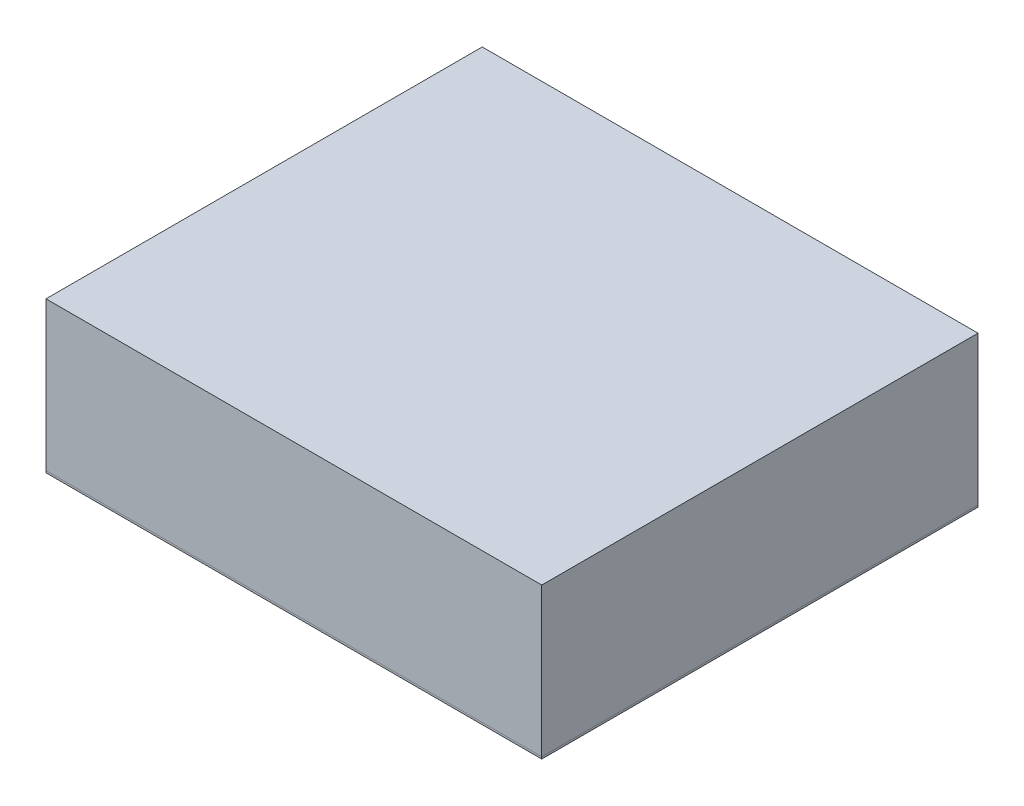
ISO-10303-21;
HEADER;
FILE_DESCRIPTION(('STEP AP214'),'2;1');
FILE_NAME('part.step','',(''),(''),'','','');
FILE_SCHEMA(('AUTOMOTIVE_DESIGN { 1 0 10303 214 1 1 1 1 }'));
ENDSEC;
DATA;
#1=APPLICATION_CONTEXT('core data for automotive mechanical design processes');
#2=APPLICATION_PROTOCOL_DEFINITION('international standard','automotive_design',2000,#1);
#3=PRODUCT_CONTEXT('',#1,'mechanical');
#4=PRODUCT('Part','Part','',(#3));
#5=PRODUCT_RELATED_PRODUCT_CATEGORY('part','',(#4));
#6=PRODUCT_DEFINITION_FORMATION('','',#4);
#7=PRODUCT_DEFINITION_CONTEXT('part definition',#1,'design');
#8=PRODUCT_DEFINITION('design','',#6,#7);
#9=PRODUCT_DEFINITION_SHAPE('','',#8);
#10=(LENGTH_UNIT() NAMED_UNIT(*) SI_UNIT(.MILLI.,.METRE.));
#11=(NAMED_UNIT(*) PLANE_ANGLE_UNIT() SI_UNIT($,.RADIAN.));
#12=(NAMED_UNIT(*) SI_UNIT($,.STERADIAN.) SOLID_ANGLE_UNIT());
#13=UNCERTAINTY_MEASURE_WITH_UNIT(LENGTH_MEASURE(1.E-05),#10,'distance_accuracy_value','');
#14=(GEOMETRIC_REPRESENTATION_CONTEXT(3) GLOBAL_UNCERTAINTY_ASSIGNED_CONTEXT((#13)) GLOBAL_UNIT_ASSIGNED_CONTEXT((#10,
#11,#12)) REPRESENTATION_CONTEXT('',''));
#15=CARTESIAN_POINT('',(0.,0.,0.));
#16=DIRECTION('',(0.,0.,1.));
#17=DIRECTION('',(1.,0.,0.));
#18=AXIS2_PLACEMENT_3D('',#15,#16,#17);
#19=CARTESIAN_POINT('',(-15.875,-4.88950000000001,13.97));
#20=DIRECTION('',(1.,0.,0.));
#21=DIRECTION('',(0.,0.,-1.));
#22=AXIS2_PLACEMENT_3D('',#19,#20,#21);
#23=PLANE('',#22);
#24=DIRECTION('',(0.,0.,-1.));
#25=VECTOR('',#24,1.);
#26=CARTESIAN_POINT('',(-15.875,-4.76250000000001,13.97));
#27=LINE('',#26,#25);
#28=CARTESIAN_POINT('',(-15.875,-4.76250000000001,13.97));
#29=VERTEX_POINT('',#28);
#30=CARTESIAN_POINT('',(-15.875,-4.76250000000001,-13.97));
#31=VERTEX_POINT('',#30);
#32=EDGE_CURVE('E106',#29,#31,#27,.T.);
#33=ORIENTED_EDGE('',*,*,#32,.T.);
#34=DIRECTION('',(0.,1.,0.));
#35=VECTOR('',#34,1.);
#36=CARTESIAN_POINT('',(-15.875,-4.88950000000001,-13.97));
#37=LINE('',#36,#35);
#38=CARTESIAN_POINT('',(-15.875,-4.88950000000001,-13.97));
#39=VERTEX_POINT('',#38);
#40=EDGE_CURVE('E12',#39,#31,#37,.T.);
#41=ORIENTED_EDGE('',*,*,#40,.F.);
#42=DIRECTION('',(0.,0.,-1.));
#43=VECTOR('',#42,1.);
#44=CARTESIAN_POINT('',(-15.875,-4.88950000000001,13.97));
#45=LINE('',#44,#43);
#46=CARTESIAN_POINT('',(-15.875,-4.88950000000001,13.97));
#47=VERTEX_POINT('',#46);
#48=EDGE_CURVE('E94',#47,#39,#45,.T.);
#49=ORIENTED_EDGE('',*,*,#48,.F.);
#50=DIRECTION('',(0.,1.,0.));
#51=VECTOR('',#50,1.);
#52=CARTESIAN_POINT('',(-15.875,-4.88950000000001,13.97));
#53=LINE('',#52,#51);
#54=EDGE_CURVE('E102',#47,#29,#53,.T.);
#55=ORIENTED_EDGE('',*,*,#54,.T.);
#56=EDGE_LOOP('',(#33,#41,#49,#55));
#57=FACE_BOUND('',#56,.T.);
#58=ADVANCED_FACE('F43',(#57),#23,.F.);
#59=CARTESIAN_POINT('',(-15.875,-4.88950000000001,-13.97));
#60=DIRECTION('',(0.,0.,1.));
#61=DIRECTION('',(1.,0.,0.));
#62=AXIS2_PLACEMENT_3D('',#59,#60,#61);
#63=PLANE('',#62);
#64=DIRECTION('',(1.,0.,0.));
#65=VECTOR('',#64,1.);
#66=CARTESIAN_POINT('',(-15.875,-4.76250000000001,-13.97));
#67=LINE('',#66,#65);
#68=CARTESIAN_POINT('',(15.875,-4.76250000000001,-13.97));
#69=VERTEX_POINT('',#68);
#70=EDGE_CURVE('E98',#31,#69,#67,.T.);
#71=ORIENTED_EDGE('',*,*,#70,.T.);
#72=DIRECTION('',(0.,1.,0.));
#73=VECTOR('',#72,1.);
#74=CARTESIAN_POINT('',(15.875,-4.88950000000001,-13.97));
#75=LINE('',#74,#73);
#76=CARTESIAN_POINT('',(15.875,-4.88950000000001,-13.97));
#77=VERTEX_POINT('',#76);
#78=EDGE_CURVE('E51',#77,#69,#75,.T.);
#79=ORIENTED_EDGE('',*,*,#78,.F.);
#80=DIRECTION('',(1.,0.,0.));
#81=VECTOR('',#80,1.);
#82=CARTESIAN_POINT('',(-15.875,-4.88950000000001,-13.97));
#83=LINE('',#82,#81);
#84=EDGE_CURVE('E89',#39,#77,#83,.T.);
#85=ORIENTED_EDGE('',*,*,#84,.F.);
#86=ORIENTED_EDGE('',*,*,#40,.T.);
#87=EDGE_LOOP('',(#71,#79,#85,#86));
#88=FACE_BOUND('',#87,.T.);
#89=ADVANCED_FACE('F97',(#88),#63,.F.);
#90=CARTESIAN_POINT('',(15.875,-4.88950000000001,-13.97));
#91=DIRECTION('',(-1.,0.,0.));
#92=DIRECTION('',(0.,0.,1.));
#93=AXIS2_PLACEMENT_3D('',#90,#91,#92);
#94=PLANE('',#93);
#95=DIRECTION('',(0.,0.,1.));
#96=VECTOR('',#95,1.);
#97=CARTESIAN_POINT('',(15.875,-4.76250000000001,-13.97));
#98=LINE('',#97,#96);
#99=CARTESIAN_POINT('',(15.875,-4.76250000000001,13.97));
#100=VERTEX_POINT('',#99);
#101=EDGE_CURVE('E76',#69,#100,#98,.T.);
#102=ORIENTED_EDGE('',*,*,#101,.T.);
#103=DIRECTION('',(0.,1.,0.));
#104=VECTOR('',#103,1.);
#105=CARTESIAN_POINT('',(15.875,-4.88950000000001,13.97));
#106=LINE('',#105,#104);
#107=CARTESIAN_POINT('',(15.875,-4.88950000000001,13.97));
#108=VERTEX_POINT('',#107);
#109=EDGE_CURVE('E99',#108,#100,#106,.T.);
#110=ORIENTED_EDGE('',*,*,#109,.F.);
#111=DIRECTION('',(0.,0.,1.));
#112=VECTOR('',#111,1.);
#113=CARTESIAN_POINT('',(15.875,-4.88950000000001,-13.97));
#114=LINE('',#113,#112);
#115=EDGE_CURVE('E92',#77,#108,#114,.T.);
#116=ORIENTED_EDGE('',*,*,#115,.F.);
#117=ORIENTED_EDGE('',*,*,#78,.T.);
#118=EDGE_LOOP('',(#102,#110,#116,#117));
#119=FACE_BOUND('',#118,.T.);
#120=ADVANCED_FACE('F100',(#119),#94,.F.);
#121=CARTESIAN_POINT('',(15.875,-4.88950000000001,13.97));
#122=DIRECTION('',(0.,0.,-1.));
#123=DIRECTION('',(-1.,0.,0.));
#124=AXIS2_PLACEMENT_3D('',#121,#122,#123);
#125=PLANE('',#124);
#126=DIRECTION('',(-1.,0.,0.));
#127=VECTOR('',#126,1.);
#128=CARTESIAN_POINT('',(15.875,-4.76250000000001,13.97));
#129=LINE('',#128,#127);
#130=EDGE_CURVE('E82',#100,#29,#129,.T.);
#131=ORIENTED_EDGE('',*,*,#130,.T.);
#132=ORIENTED_EDGE('',*,*,#54,.F.);
#133=DIRECTION('',(-1.,0.,0.));
#134=VECTOR('',#133,1.);
#135=CARTESIAN_POINT('',(15.875,-4.88950000000001,13.97));
#136=LINE('',#135,#134);
#137=EDGE_CURVE('E59',#108,#47,#136,.T.);
#138=ORIENTED_EDGE('',*,*,#137,.F.);
#139=ORIENTED_EDGE('',*,*,#109,.T.);
#140=EDGE_LOOP('',(#131,#132,#138,#139));
#141=FACE_BOUND('',#140,.T.);
#142=ADVANCED_FACE('F113',(#141),#125,.F.);
#143=CARTESIAN_POINT('',(0.,-4.88950000000001,0.));
#144=DIRECTION('',(0.,-1.,0.));
#145=DIRECTION('',(0.,0.,-1.));
#146=AXIS2_PLACEMENT_3D('',#143,#144,#145);
#147=PLANE('',#146);
#148=ORIENTED_EDGE('',*,*,#48,.T.);
#149=ORIENTED_EDGE('',*,*,#84,.T.);
#150=ORIENTED_EDGE('',*,*,#115,.T.);
#151=ORIENTED_EDGE('',*,*,#137,.T.);
#152=EDGE_LOOP('',(#148,#149,#150,#151));
#153=FACE_BOUND('',#152,.T.);
#154=ADVANCED_FACE('F90',(#153),#147,.T.);
#155=CARTESIAN_POINT('',(0.,-4.76250000000001,0.));
#156=DIRECTION('',(0.,-1.,0.));
#157=DIRECTION('',(0.,0.,-1.));
#158=AXIS2_PLACEMENT_3D('',#155,#156,#157);
#159=PLANE('',#158);
#160=ORIENTED_EDGE('',*,*,#32,.F.);
#161=ORIENTED_EDGE('',*,*,#130,.F.);
#162=ORIENTED_EDGE('',*,*,#101,.F.);
#163=ORIENTED_EDGE('',*,*,#70,.F.);
#164=EDGE_LOOP('',(#160,#161,#162,#163));
#165=FACE_BOUND('',#164,.T.);
#166=ADVANCED_FACE('F116',(#165),#159,.F.);
#167=CLOSED_SHELL('',(#58,#89,#120,#142,#154,#166));
#168=MANIFOLD_SOLID_BREP('B2',#167);
#169=CARTESIAN_POINT('',(-15.875,-4.76250000000001,13.97));
#170=DIRECTION('',(1.,0.,0.));
#171=DIRECTION('',(0.,0.,-1.));
#172=AXIS2_PLACEMENT_3D('',#169,#170,#171);
#173=PLANE('',#172);
#174=DIRECTION('',(0.,-1.,0.));
#175=VECTOR('',#174,1.);
#176=CARTESIAN_POINT('',(-15.875,-4.76250000000001,-13.97));
#177=LINE('',#176,#175);
#178=CARTESIAN_POINT('',(-15.875,4.76249999999999,-13.97));
#179=VERTEX_POINT('',#178);
#180=CARTESIAN_POINT('',(-15.875,-4.76250000000001,-13.97));
#181=VERTEX_POINT('',#180);
#182=EDGE_CURVE('E230',#179,#181,#177,.T.);
#183=ORIENTED_EDGE('',*,*,#182,.T.);
#184=DIRECTION('',(0.,0.,-1.));
#185=VECTOR('',#184,1.);
#186=CARTESIAN_POINT('',(-15.875,-4.76250000000001,13.97));
#187=LINE('',#186,#185);
#188=CARTESIAN_POINT('',(-15.875,-4.76250000000001,13.97));
#189=VERTEX_POINT('',#188);
#190=EDGE_CURVE('E41',#189,#181,#187,.T.);
#191=ORIENTED_EDGE('',*,*,#190,.F.);
#192=DIRECTION('',(0.,-1.,0.));
#193=VECTOR('',#192,1.);
#194=CARTESIAN_POINT('',(-15.875,-4.76250000000001,13.97));
#195=LINE('',#194,#193);
#196=CARTESIAN_POINT('',(-15.875,4.76249999999999,13.97));
#197=VERTEX_POINT('',#196);
#198=EDGE_CURVE('E218',#197,#189,#195,.T.);
#199=ORIENTED_EDGE('',*,*,#198,.F.);
#200=DIRECTION('',(0.,0.,-1.));
#201=VECTOR('',#200,1.);
#202=CARTESIAN_POINT('',(-15.875,4.76249999999999,13.97));
#203=LINE('',#202,#201);
#204=EDGE_CURVE('E226',#197,#179,#203,.T.);
#205=ORIENTED_EDGE('',*,*,#204,.T.);
#206=EDGE_LOOP('',(#183,#191,#199,#205));
#207=FACE_BOUND('',#206,.T.);
#208=ADVANCED_FACE('F167',(#207),#173,.F.);
#209=CARTESIAN_POINT('',(15.875,-4.76250000000001,13.97));
#210=DIRECTION('',(0.,1.,0.));
#211=DIRECTION('',(0.,0.,1.));
#212=AXIS2_PLACEMENT_3D('',#209,#210,#211);
#213=PLANE('',#212);
#214=DIRECTION('',(1.,0.,0.));
#215=VECTOR('',#214,1.);
#216=CARTESIAN_POINT('',(15.875,-4.76250000000001,-13.97));
#217=LINE('',#216,#215);
#218=CARTESIAN_POINT('',(15.875,-4.76250000000001,-13.97));
#219=VERTEX_POINT('',#218);
#220=EDGE_CURVE('E222',#181,#219,#217,.T.);
#221=ORIENTED_EDGE('',*,*,#220,.T.);
#222=DIRECTION('',(0.,0.,-1.));
#223=VECTOR('',#222,1.);
#224=CARTESIAN_POINT('',(15.875,-4.76250000000001,13.97));
#225=LINE('',#224,#223);
#226=CARTESIAN_POINT('',(15.875,-4.76250000000001,13.97));
#227=VERTEX_POINT('',#226);
#228=EDGE_CURVE('E175',#227,#219,#225,.T.);
#229=ORIENTED_EDGE('',*,*,#228,.F.);
#230=DIRECTION('',(1.,0.,0.));
#231=VECTOR('',#230,1.);
#232=CARTESIAN_POINT('',(15.875,-4.76250000000001,13.97));
#233=LINE('',#232,#231);
#234=EDGE_CURVE('E213',#189,#227,#233,.T.);
#235=ORIENTED_EDGE('',*,*,#234,.F.);
#236=ORIENTED_EDGE('',*,*,#190,.T.);
#237=EDGE_LOOP('',(#221,#229,#235,#236));
#238=FACE_BOUND('',#237,.T.);
#239=ADVANCED_FACE('F221',(#238),#213,.F.);
#240=CARTESIAN_POINT('',(15.875,4.76249999999999,13.97));
#241=DIRECTION('',(-1.,0.,0.));
#242=DIRECTION('',(0.,0.,1.));
#243=AXIS2_PLACEMENT_3D('',#240,#241,#242);
#244=PLANE('',#243);
#245=DIRECTION('',(0.,1.,0.));
#246=VECTOR('',#245,1.);
#247=CARTESIAN_POINT('',(15.875,4.76249999999999,-13.97));
#248=LINE('',#247,#246);
#249=CARTESIAN_POINT('',(15.875,4.76249999999999,-13.97));
#250=VERTEX_POINT('',#249);
#251=EDGE_CURVE('E200',#219,#250,#248,.T.);
#252=ORIENTED_EDGE('',*,*,#251,.T.);
#253=DIRECTION('',(0.,0.,-1.));
#254=VECTOR('',#253,1.);
#255=CARTESIAN_POINT('',(15.875,4.76249999999999,13.97));
#256=LINE('',#255,#254);
#257=CARTESIAN_POINT('',(15.875,4.76249999999999,13.97));
#258=VERTEX_POINT('',#257);
#259=EDGE_CURVE('E223',#258,#250,#256,.T.);
#260=ORIENTED_EDGE('',*,*,#259,.F.);
#261=DIRECTION('',(0.,1.,0.));
#262=VECTOR('',#261,1.);
#263=CARTESIAN_POINT('',(15.875,4.76249999999999,13.97));
#264=LINE('',#263,#262);
#265=EDGE_CURVE('E216',#227,#258,#264,.T.);
#266=ORIENTED_EDGE('',*,*,#265,.F.);
#267=ORIENTED_EDGE('',*,*,#228,.T.);
#268=EDGE_LOOP('',(#252,#260,#266,#267));
#269=FACE_BOUND('',#268,.T.);
#270=ADVANCED_FACE('F224',(#269),#244,.F.);
#271=CARTESIAN_POINT('',(-15.875,4.76249999999999,13.97));
#272=DIRECTION('',(0.,-1.,0.));
#273=DIRECTION('',(0.,0.,-1.));
#274=AXIS2_PLACEMENT_3D('',#271,#272,#273);
#275=PLANE('',#274);
#276=DIRECTION('',(-1.,0.,0.));
#277=VECTOR('',#276,1.);
#278=CARTESIAN_POINT('',(-15.875,4.76249999999999,-13.97));
#279=LINE('',#278,#277);
#280=EDGE_CURVE('E206',#250,#179,#279,.T.);
#281=ORIENTED_EDGE('',*,*,#280,.T.);
#282=ORIENTED_EDGE('',*,*,#204,.F.);
#283=DIRECTION('',(-1.,0.,0.));
#284=VECTOR('',#283,1.);
#285=CARTESIAN_POINT('',(-15.875,4.76249999999999,13.97));
#286=LINE('',#285,#284);
#287=EDGE_CURVE('E183',#258,#197,#286,.T.);
#288=ORIENTED_EDGE('',*,*,#287,.F.);
#289=ORIENTED_EDGE('',*,*,#259,.T.);
#290=EDGE_LOOP('',(#281,#282,#288,#289));
#291=FACE_BOUND('',#290,.T.);
#292=ADVANCED_FACE('F237',(#291),#275,.F.);
#293=CARTESIAN_POINT('',(0.,0.,13.97));
#294=DIRECTION('',(0.,0.,-1.));
#295=DIRECTION('',(-1.,0.,0.));
#296=AXIS2_PLACEMENT_3D('',#293,#294,#295);
#297=PLANE('',#296);
#298=ORIENTED_EDGE('',*,*,#198,.T.);
#299=ORIENTED_EDGE('',*,*,#234,.T.);
#300=ORIENTED_EDGE('',*,*,#265,.T.);
#301=ORIENTED_EDGE('',*,*,#287,.T.);
#302=EDGE_LOOP('',(#298,#299,#300,#301));
#303=FACE_BOUND('',#302,.T.);
#304=ADVANCED_FACE('F214',(#303),#297,.F.);
#305=CARTESIAN_POINT('',(0.,0.,-13.97));
#306=DIRECTION('',(0.,0.,-1.));
#307=DIRECTION('',(-1.,0.,0.));
#308=AXIS2_PLACEMENT_3D('',#305,#306,#307);
#309=PLANE('',#308);
#310=ORIENTED_EDGE('',*,*,#182,.F.);
#311=ORIENTED_EDGE('',*,*,#280,.F.);
#312=ORIENTED_EDGE('',*,*,#251,.F.);
#313=ORIENTED_EDGE('',*,*,#220,.F.);
#314=EDGE_LOOP('',(#310,#311,#312,#313));
#315=FACE_BOUND('',#314,.T.);
#316=ADVANCED_FACE('F240',(#315),#309,.T.);
#317=CLOSED_SHELL('',(#208,#239,#270,#292,#304,#316));
#318=MANIFOLD_SOLID_BREP('B6',#317);
#319=ADVANCED_BREP_SHAPE_REPRESENTATION('',(#18,#168,#318),#14);
#320=SHAPE_DEFINITION_REPRESENTATION(#9,#319);
ENDSEC;
END-ISO-10303-21;
